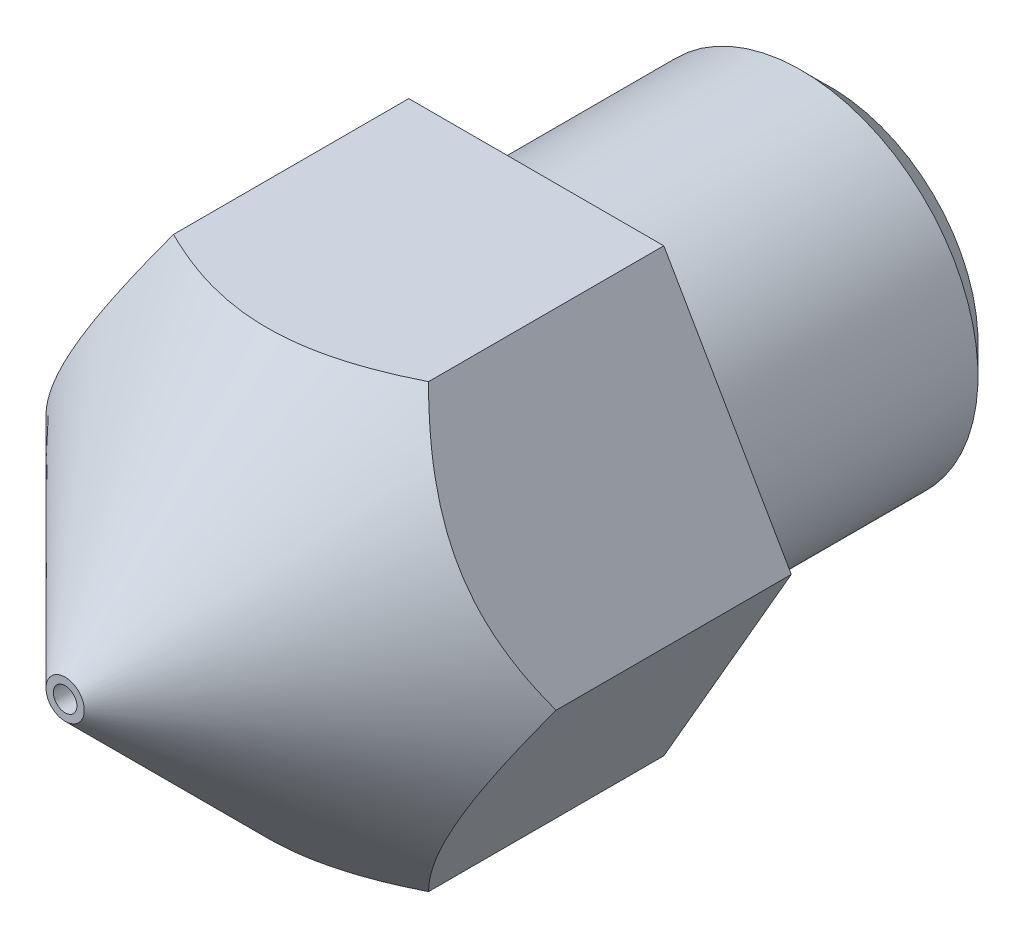
ISO-10303-21;
HEADER;
FILE_DESCRIPTION(('STEP AP214'),'2;1');
FILE_NAME('part.step','',(''),(''),'','','');
FILE_SCHEMA(('AUTOMOTIVE_DESIGN { 1 0 10303 214 1 1 1 1 }'));
ENDSEC;
DATA;
#1=APPLICATION_CONTEXT('core data for automotive mechanical design processes');
#2=APPLICATION_PROTOCOL_DEFINITION('international standard','automotive_design',2000,#1);
#3=PRODUCT_CONTEXT('',#1,'mechanical');
#4=PRODUCT('Part','Part','',(#3));
#5=PRODUCT_RELATED_PRODUCT_CATEGORY('part','',(#4));
#6=PRODUCT_DEFINITION_FORMATION('','',#4);
#7=PRODUCT_DEFINITION_CONTEXT('part definition',#1,'design');
#8=PRODUCT_DEFINITION('design','',#6,#7);
#9=PRODUCT_DEFINITION_SHAPE('','',#8);
#10=(LENGTH_UNIT() NAMED_UNIT(*) SI_UNIT(.MILLI.,.METRE.));
#11=(NAMED_UNIT(*) PLANE_ANGLE_UNIT() SI_UNIT($,.RADIAN.));
#12=(NAMED_UNIT(*) SI_UNIT($,.STERADIAN.) SOLID_ANGLE_UNIT());
#13=UNCERTAINTY_MEASURE_WITH_UNIT(LENGTH_MEASURE(1.E-05),#10,'distance_accuracy_value','');
#14=(GEOMETRIC_REPRESENTATION_CONTEXT(3) GLOBAL_UNCERTAINTY_ASSIGNED_CONTEXT((#13)) GLOBAL_UNIT_ASSIGNED_CONTEXT((#10,
#11,#12)) REPRESENTATION_CONTEXT('',''));
#15=CARTESIAN_POINT('',(0.,0.,0.));
#16=DIRECTION('',(0.,0.,1.));
#17=DIRECTION('',(1.,0.,0.));
#18=AXIS2_PLACEMENT_3D('',#15,#16,#17);
#19=CARTESIAN_POINT('',(0.,0.,13.));
#20=DIRECTION('',(0.,0.,-1.));
#21=DIRECTION('',(-1.,0.,0.));
#22=AXIS2_PLACEMENT_3D('',#19,#20,#21);
#23=CONICAL_SURFACE('',#22,0.325000000000002,0.785398163397447);
#24=CARTESIAN_POINT('',(0.,0.,13.));
#25=DIRECTION('',(0.,0.,-1.));
#26=DIRECTION('',(-1.,0.,0.));
#27=AXIS2_PLACEMENT_3D('',#24,#25,#26);
#28=CIRCLE('',#27,0.325000000000002);
#29=CARTESIAN_POINT('',(-0.325000000000002,0.,13.));
#30=VERTEX_POINT('',#29);
#31=EDGE_CURVE('E189',#30,#30,#28,.T.);
#32=ORIENTED_EDGE('',*,*,#31,.T.);
#33=EDGE_LOOP('',(#32));
#34=FACE_BOUND('',#33,.T.);
#35=CARTESIAN_POINT('',(2.16494803940726,3.7502,8.99475750640527));
#36=CARTESIAN_POINT('',(2.20217705704305,3.68571744993894,9.03198286474026));
#37=CARTESIAN_POINT('',(2.23969096480962,3.62074145569679,9.06806617459662));
#38=CARTESIAN_POINT('',(2.31534724663345,3.48970093166616,9.13760057553458));
#39=CARTESIAN_POINT('',(2.35348995039741,3.42363583080893,9.17105022890731));
#40=CARTESIAN_POINT('',(2.46930370458929,3.22304052433329,9.26721179995003));
#41=CARTESIAN_POINT('',(2.54795906193632,3.08680544912077,9.32532603800888));
#42=CARTESIAN_POINT('',(2.70654314168565,2.81212976572336,9.4248497124022));
#43=CARTESIAN_POINT('',(2.7864318058688,2.67375854040935,9.46650977518386));
#44=CARTESIAN_POINT('',(2.94797321962136,2.3939606042634,9.53070134886704));
#45=CARTESIAN_POINT('',(3.02962102165828,2.25254246280913,9.5532807529882));
#46=CARTESIAN_POINT('',(3.17033742746209,2.00881449849844,9.57365267581302));
#47=CARTESIAN_POINT('',(3.22922472766649,1.90681870262386,9.57666772541387));
#48=CARTESIAN_POINT('',(3.34690375410711,1.70299264984347,9.57158555664633));
#49=CARTESIAN_POINT('',(3.4056954396071,1.60116246349488,9.56348444279472));
#50=CARTESIAN_POINT('',(3.52272175140972,1.39846694563034,9.53663202755894));
#51=CARTESIAN_POINT('',(3.5809556804583,1.29760282179385,9.51786881430989));
#52=CARTESIAN_POINT('',(3.69642340427653,1.09760685750634,9.47071645004091));
#53=CARTESIAN_POINT('',(3.75365727537385,0.998474884851932,9.44232803705166));
#54=CARTESIAN_POINT('',(3.85526187899324,0.822490549100253,9.38392137074101));
#55=CARTESIAN_POINT('',(3.89985755017936,0.745248580808259,9.35543868943839));
#56=CARTESIAN_POINT('',(3.98824830682869,0.592151299372155,9.29388306115367));
#57=CARTESIAN_POINT('',(4.03204336787686,0.516296028516144,9.26080997444805));
#58=CARTESIAN_POINT('',(4.11869492515951,0.366211128747631,9.19081496732349));
#59=CARTESIAN_POINT('',(4.16155388593438,0.29197723112596,9.15390514980141));
#60=CARTESIAN_POINT('',(4.24647809631472,0.144884183954545,9.07672137714441));
#61=CARTESIAN_POINT('',(4.28854381375498,0.0720242240911695,9.03644948611482));
#62=CARTESIAN_POINT('',(4.33024248897603,-0.000200000000002146,8.99475750640527));
#63=B_SPLINE_CURVE_WITH_KNOTS('',3,(#35,#36,#37,#38,#39,#40,#41,#42,#43,#44,#45,#46,#47,#48,#49,
#50,#51,#52,#53,#54,#55,#56,#57,#58,#59,#60,#61,#62),.UNSPECIFIED.,.F.,.F.,(4,2,2,2,2,2,2,2,2,2,
2,2,2,4),(0.,0.249716048117295,0.49956748405372,1.00196815812475,1.49639040117115,
1.98956790685464,2.34250890260464,2.69557361252159,3.04903354958699,3.40246639055996,
3.68322121867435,3.96398459432619,4.24388774030484,4.52362028927155),.UNSPECIFIED.);
#64=CARTESIAN_POINT('',(2.1650635094611,3.75,8.99487298107779));
#65=VERTEX_POINT('',#64);
#66=CARTESIAN_POINT('',(4.3301270189222,0.,8.99487298107779));
#67=VERTEX_POINT('',#66);
#68=EDGE_CURVE('E159',#65,#67,#63,.T.);
#69=ORIENTED_EDGE('',*,*,#68,.F.);
#70=CARTESIAN_POINT('',(-14.6386519959163,3.75,-1.78634117997296));
#71=CARTESIAN_POINT('',(-14.2499350475933,3.75,-1.40981785833932));
#72=CARTESIAN_POINT('',(-13.8607884049401,3.75,-1.03373620647734));
#73=CARTESIAN_POINT('',(-13.0812850755396,3.75,-0.282767389143212));
#74=CARTESIAN_POINT('',(-12.6909282952341,3.75,0.0921196791879649));
#75=CARTESIAN_POINT('',(-11.9073864829059,3.75,0.841599680461632));
#76=CARTESIAN_POINT('',(-11.5141963476314,3.75,1.21618728420928));
#77=CARTESIAN_POINT('',(-10.725832141377,3.75,1.96321691632955));
#78=CARTESIAN_POINT('',(-10.3306582042045,3.75,2.33565908586739));
#79=CARTESIAN_POINT('',(-9.48751415713359,3.75,3.12449457448067));
#80=CARTESIAN_POINT('',(-9.03917871061251,3.75,3.54049877142708));
#81=CARTESIAN_POINT('',(-8.36278170882862,3.75,4.16036229387595));
#82=CARTESIAN_POINT('',(-8.13664071094535,3.75,4.36631656706569));
#83=CARTESIAN_POINT('',(-7.68275517403944,3.75,4.77644818100323));
#84=CARTESIAN_POINT('',(-7.45501065185341,3.75,4.980625540358));
#85=CARTESIAN_POINT('',(-6.9979388297345,3.75,5.38632349583382));
#86=CARTESIAN_POINT('',(-6.76861536690088,3.75,5.58784840860894));
#87=CARTESIAN_POINT('',(-6.30739688109312,3.75,5.9879319993884));
#88=CARTESIAN_POINT('',(-6.07550191271853,3.75,6.18649074016273));
#89=CARTESIAN_POINT('',(-5.60843315979353,3.75,6.579549493808));
#90=CARTESIAN_POINT('',(-5.37326059170391,3.75,6.77405094894264));
#91=CARTESIAN_POINT('',(-4.89846240252294,3.75,7.15752567104833));
#92=CARTESIAN_POINT('',(-4.65883733346967,3.75,7.34649961596071));
#93=CARTESIAN_POINT('',(-4.30029035324444,3.75,7.61978930756026));
#94=CARTESIAN_POINT('',(-4.18372409705692,3.75,7.70719509419748));
#95=CARTESIAN_POINT('',(-3.9489488565422,3.75,7.87978681113343));
#96=CARTESIAN_POINT('',(-3.83073981613803,3.75,7.96497266536726));
#97=CARTESIAN_POINT('',(-3.5922594172301,3.75,8.13273291066193));
#98=CARTESIAN_POINT('',(-3.47198569560841,3.75,8.21530395229492));
#99=CARTESIAN_POINT('',(-3.22918850523287,3.75,8.37707527196928));
#100=CARTESIAN_POINT('',(-3.10666510596204,3.75,8.45627565386622));
#101=CARTESIAN_POINT('',(-2.8607550156929,3.75,8.60935681121756));
#102=CARTESIAN_POINT('',(-2.73740582657593,3.75,8.68329753260382));
#103=CARTESIAN_POINT('',(-2.48771602937876,3.75,8.82602971275283));
#104=CARTESIAN_POINT('',(-2.36137493205706,3.75,8.89482032160027));
#105=CARTESIAN_POINT('',(-2.1055604004599,3.75,9.02571742567049));
#106=CARTESIAN_POINT('',(-1.97609357884479,3.75,9.08783673614048));
#107=CARTESIAN_POINT('',(-1.71351357955835,3.75,9.20374230228365));
#108=CARTESIAN_POINT('',(-1.58040236195262,3.75,9.25753293764283));
#109=CARTESIAN_POINT('',(-1.32791809670304,3.75,9.34833524201216));
#110=CARTESIAN_POINT('',(-1.20900671407626,3.75,9.38661885295907));
#111=CARTESIAN_POINT('',(-0.968499851293341,3.75,9.45367341653336));
#112=CARTESIAN_POINT('',(-0.846904577001409,3.75,9.48244509607407));
#113=CARTESIAN_POINT('',(-0.602349977135241,3.75,9.52881560897667));
#114=CARTESIAN_POINT('',(-0.47940382096303,3.75,9.54648275164277));
#115=CARTESIAN_POINT('',(-0.232368181245821,3.75,9.56981833085271));
#116=CARTESIAN_POINT('',(-0.108278826510831,3.75,9.57548810298873));
#117=CARTESIAN_POINT('',(0.136057623209196,3.75,9.57446138393147));
#118=CARTESIAN_POINT('',(0.256306465037792,3.75,9.56813681512276));
#119=CARTESIAN_POINT('',(0.495671858674488,3.75,9.54425936151283));
#120=CARTESIAN_POINT('',(0.614788342097327,3.75,9.52670580288889));
#121=CARTESIAN_POINT('',(0.851731653992345,3.75,9.48126041894918));
#122=CARTESIAN_POINT('',(0.9695466812008,3.75,9.45330803666982));
#123=CARTESIAN_POINT('',(1.20266463899952,3.75,9.38845899970364));
#124=CARTESIAN_POINT('',(1.31796732369718,3.75,9.35156147376884));
#125=CARTESIAN_POINT('',(1.55710974511649,3.75,9.26625599478381));
#126=CARTESIAN_POINT('',(1.68066993399641,3.75,9.21707173061441));
#127=CARTESIAN_POINT('',(1.92462614014912,3.75,9.11138034985307));
#128=CARTESIAN_POINT('',(2.0450211462328,3.75,9.05487092646162));
#129=CARTESIAN_POINT('',(2.28306265861194,3.75,8.93589646370744));
#130=CARTESIAN_POINT('',(2.40070418203018,3.75,8.87342153161685));
#131=CARTESIAN_POINT('',(2.63333307868828,3.75,8.74377540724685));
#132=CARTESIAN_POINT('',(2.74832079999608,3.75,8.67660483554894));
#133=CARTESIAN_POINT('',(2.97749092968317,3.75,8.53756353312444));
#134=CARTESIAN_POINT('',(3.09164263783865,3.75,8.46564243772143));
#135=CARTESIAN_POINT('',(3.31789567554612,3.75,8.31865021869839));
#136=CARTESIAN_POINT('',(3.42999695238471,3.75,8.24357901425692));
#137=CARTESIAN_POINT('',(3.65231370578582,3.75,8.09094114965254));
#138=CARTESIAN_POINT('',(3.76253099312431,3.75,8.01337711917717));
#139=CARTESIAN_POINT('',(3.98143415992465,3.75,7.85613141319268));
#140=CARTESIAN_POINT('',(4.09012009842175,3.75,7.77644981966172));
#141=CARTESIAN_POINT('',(4.32458059261932,3.75,7.60159225853655));
#142=CARTESIAN_POINT('',(4.4501112576079,3.75,7.50608967885561));
#143=CARTESIAN_POINT('',(4.69964235334507,3.75,7.31310345339998));
#144=CARTESIAN_POINT('',(4.82364273721207,3.75,7.2156197471726));
#145=CARTESIAN_POINT('',(5.19372861565919,3.75,6.92070492662386));
#146=CARTESIAN_POINT('',(5.43786875300338,3.75,6.72083281307475));
#147=CARTESIAN_POINT('',(5.9224357281442,3.75,6.31643351655192));
#148=CARTESIAN_POINT('',(6.16286074352854,3.75,6.11190416354314));
#149=CARTESIAN_POINT('',(6.64082051717539,3.75,5.69948896715153));
#150=CARTESIAN_POINT('',(6.87835519736209,3.75,5.49160303344976));
#151=CARTESIAN_POINT('',(7.35171780729667,3.75,5.07284513561662));
#152=CARTESIAN_POINT('',(7.58754075135803,3.75,4.8619675476267));
#153=CARTESIAN_POINT('',(8.05742267917519,3.75,4.43825202887371));
#154=CARTESIAN_POINT('',(8.2914816372209,3.75,4.22541406963829));
#155=CARTESIAN_POINT('',(8.99142216149712,3.75,3.58474290256203));
#156=CARTESIAN_POINT('',(9.45521092254354,3.75,3.15462442258876));
#157=CARTESIAN_POINT('',(10.3245425469641,3.75,2.34145853210023));
#158=CARTESIAN_POINT('',(10.7304970398764,3.75,1.95884952292607));
#159=CARTESIAN_POINT('',(11.5403293668149,3.75,1.1913694393374));
#160=CARTESIAN_POINT('',(11.9442070146313,3.75,0.806498168496878));
#161=CARTESIAN_POINT('',(12.7487672717472,3.75,0.0366620574756648));
#162=CARTESIAN_POINT('',(13.1494561983004,3.75,-0.348296188306188));
#163=CARTESIAN_POINT('',(13.9495703198245,3.75,-1.1194426635813));
#164=CARTESIAN_POINT('',(14.3489956394169,3.75,-1.50563076373316));
#165=CARTESIAN_POINT('',(14.7479791513934,3.75,-1.89227272049551));
#166=B_SPLINE_CURVE_WITH_KNOTS('',3,(#70,#71,#72,#73,#74,#75,#76,#77,#78,#79,#80,#81,#82,#83,
#84,#85,#86,#87,#88,#89,#90,#91,#92,#93,#94,#95,#96,#97,#98,#99,#100,#101,#102,#103,#104,#105,
#106,#107,#108,#109,#110,#111,#112,#113,#114,#115,#116,#117,#118,#119,#120,#121,#122,#123,#124,
#125,#126,#127,#128,#129,#130,#131,#132,#133,#134,#135,#136,#137,#138,#139,#140,#141,#142,#143,
#144,#145,#146,#147,#148,#149,#150,#151,#152,#153,#154,#155,#156,#157,#158,#159,#160,#161,#162,
#163,#164,#165),.UNSPECIFIED.,.F.,.F.,(4,2,2,2,2,2,2,2,2,2,2,2,2,2,2,2,2,2,2,2,2,2,2,2,2,2,2,2,
2,2,2,2,2,2,2,2,2,2,2,2,2,2,2,2,2,2,2,4),(0.,1.62352743360012,3.24718368180129,4.8763577567919,
6.50542338211818,8.3402097775912,9.25781508224569,10.175410766601,11.0912601475699,
12.007090119844,12.9225887899531,13.8379747005741,14.2750438553496,14.7121279664473,
15.1497510001848,15.5873605402593,16.0187020504601,16.4501145881038,16.8806829930107,
17.3110242061778,17.6854613442487,18.0598698607616,18.431952072021,18.8039928595166,
19.1646856088408,19.5254000044374,19.8882487473001,20.2511328454733,20.6498058257267,
21.0486046603172,21.4480767131981,21.8474960708097,22.2521913643678,22.6568970474321,
23.0611889805571,23.4654652848866,23.9386296389294,24.4118084529913,25.3582791075872,
26.305200177966,27.2521467707189,28.2012045055311,29.1502760462152,31.0478422382499,
32.7213626112971,34.3950305036326,36.0619709984686,37.7287416208617),.UNSPECIFIED.);
#167=CARTESIAN_POINT('',(-2.1650635094611,3.75,8.99487298107779));
#168=VERTEX_POINT('',#167);
#169=EDGE_CURVE('E166',#168,#65,#166,.T.);
#170=ORIENTED_EDGE('',*,*,#169,.F.);
#171=CARTESIAN_POINT('',(-4.33024248897603,-0.000199999999998916,8.99475750640528));
#172=CARTESIAN_POINT('',(-4.29301347134024,0.0642825500610654,9.03198286474026));
#173=CARTESIAN_POINT('',(-4.25549956357367,0.129258544303218,9.06806617459662));
#174=CARTESIAN_POINT('',(-4.17984328174984,0.260299068333847,9.13760057553458));
#175=CARTESIAN_POINT('',(-4.14170057798588,0.326364169191077,9.17105022890732));
#176=CARTESIAN_POINT('',(-4.02588682379399,0.526959475666708,9.26721179995003));
#177=CARTESIAN_POINT('',(-3.94723146644697,0.663194550879237,9.32532603800889));
#178=CARTESIAN_POINT('',(-3.78864738669763,0.937870234276646,9.42484971240221));
#179=CARTESIAN_POINT('',(-3.70875872251449,1.07624145959065,9.46650977518386));
#180=CARTESIAN_POINT('',(-3.54721730876193,1.3560393957366,9.53070134886705));
#181=CARTESIAN_POINT('',(-3.46556950672501,1.49745753719087,9.55328075298821));
#182=CARTESIAN_POINT('',(-3.3248531009212,1.74118550150156,9.57365267581302));
#183=CARTESIAN_POINT('',(-3.2659658007168,1.84318129737614,9.57666772541387));
#184=CARTESIAN_POINT('',(-3.14828677427618,2.04700735015653,9.57158555664633));
#185=CARTESIAN_POINT('',(-3.08949508877619,2.14883753650512,9.56348444279473));
#186=CARTESIAN_POINT('',(-2.97246877697357,2.35153305436966,9.53663202755894));
#187=CARTESIAN_POINT('',(-2.91423484792499,2.45239717820615,9.51786881430989));
#188=CARTESIAN_POINT('',(-2.79876712410676,2.65239314249366,9.47071645004091));
#189=CARTESIAN_POINT('',(-2.74153325300944,2.75152511514807,9.44232803705166));
#190=CARTESIAN_POINT('',(-2.63992864939005,2.92750945089975,9.38392137074101));
#191=CARTESIAN_POINT('',(-2.59533297820393,3.00475141919174,9.35543868943839));
#192=CARTESIAN_POINT('',(-2.5069422215546,3.15784870062784,9.29388306115368));
#193=CARTESIAN_POINT('',(-2.46314716050643,3.23370397148386,9.26080997444805));
#194=CARTESIAN_POINT('',(-2.37649560322378,3.38378887125237,9.19081496732349));
#195=CARTESIAN_POINT('',(-2.33363664244891,3.45802276887404,9.15390514980141));
#196=CARTESIAN_POINT('',(-2.24871243206857,3.60511581604545,9.07672137714441));
#197=CARTESIAN_POINT('',(-2.20664671462831,3.67797577590883,9.03644948611482));
#198=CARTESIAN_POINT('',(-2.16494803940726,3.7502,8.99475750640527));
#199=B_SPLINE_CURVE_WITH_KNOTS('',3,(#171,#172,#173,#174,#175,#176,#177,#178,#179,#180,#181,
#182,#183,#184,#185,#186,#187,#188,#189,#190,#191,#192,#193,#194,#195,#196,#197,#198),
.UNSPECIFIED.,.F.,.F.,(4,2,2,2,2,2,2,2,2,2,2,2,2,4),(0.,0.249716048117296,0.49956748405372,
1.00196815812475,1.49639040117115,1.98956790685463,2.34250890260463,2.69557361252159,
3.04903354958698,3.40246639055995,3.68322121867434,3.96398459432618,4.24388774030484,
4.52362028927154),.UNSPECIFIED.);
#200=CARTESIAN_POINT('',(-4.33012701892219,0.,8.99487298107779));
#201=VERTEX_POINT('',#200);
#202=EDGE_CURVE('E223',#201,#168,#199,.T.);
#203=ORIENTED_EDGE('',*,*,#202,.F.);
#204=CARTESIAN_POINT('',(-2.16494803940726,-3.7502,8.99475750640527));
#205=CARTESIAN_POINT('',(-2.20217705704305,-3.68571744993894,9.03198286474026));
#206=CARTESIAN_POINT('',(-2.23969096480962,-3.62074145569679,9.06806617459662));
#207=CARTESIAN_POINT('',(-2.31534724663345,-3.48970093166616,9.13760057553458));
#208=CARTESIAN_POINT('',(-2.35348995039741,-3.42363583080893,9.17105022890731));
#209=CARTESIAN_POINT('',(-2.46930370458929,-3.22304052433329,9.26721179995003));
#210=CARTESIAN_POINT('',(-2.54795906193632,-3.08680544912076,9.32532603800888));
#211=CARTESIAN_POINT('',(-2.70654314168566,-2.81212976572335,9.4248497124022));
#212=CARTESIAN_POINT('',(-2.7864318058688,-2.67375854040935,9.46650977518386));
#213=CARTESIAN_POINT('',(-2.94797321962136,-2.3939606042634,9.53070134886704));
#214=CARTESIAN_POINT('',(-3.02962102165828,-2.25254246280912,9.55328075298821));
#215=CARTESIAN_POINT('',(-3.1703374274621,-2.00881449849844,9.57365267581302));
#216=CARTESIAN_POINT('',(-3.22922472766649,-1.90681870262386,9.57666772541387));
#217=CARTESIAN_POINT('',(-3.34690375410711,-1.70299264984347,9.57158555664633));
#218=CARTESIAN_POINT('',(-3.4056954396071,-1.60116246349488,9.56348444279472));
#219=CARTESIAN_POINT('',(-3.52272175140972,-1.39846694563034,9.53663202755894));
#220=CARTESIAN_POINT('',(-3.5809556804583,-1.29760282179385,9.51786881430989));
#221=CARTESIAN_POINT('',(-3.69642340427653,-1.09760685750633,9.47071645004091));
#222=CARTESIAN_POINT('',(-3.75365727537385,-0.998474884851929,9.44232803705166));
#223=CARTESIAN_POINT('',(-3.85526187899324,-0.822490549100251,9.38392137074101));
#224=CARTESIAN_POINT('',(-3.89985755017936,-0.745248580808257,9.35543868943839));
#225=CARTESIAN_POINT('',(-3.98824830682869,-0.592151299372154,9.29388306115368));
#226=CARTESIAN_POINT('',(-4.03204336787686,-0.516296028516144,9.26080997444805));
#227=CARTESIAN_POINT('',(-4.11869492515951,-0.366211128747631,9.19081496732349));
#228=CARTESIAN_POINT('',(-4.16155388593438,-0.29197723112596,9.15390514980142));
#229=CARTESIAN_POINT('',(-4.24647809631472,-0.144884183954546,9.07672137714441));
#230=CARTESIAN_POINT('',(-4.28854381375498,-0.0720242240911709,9.03644948611482));
#231=CARTESIAN_POINT('',(-4.33024248897603,0.000200000000000121,8.99475750640528));
#232=B_SPLINE_CURVE_WITH_KNOTS('',3,(#204,#205,#206,#207,#208,#209,#210,#211,#212,#213,#214,
#215,#216,#217,#218,#219,#220,#221,#222,#223,#224,#225,#226,#227,#228,#229,#230,#231),
.UNSPECIFIED.,.F.,.F.,(4,2,2,2,2,2,2,2,2,2,2,2,2,4),(0.,0.249716048117295,0.499567484053721,
1.00196815812475,1.49639040117115,1.98956790685464,2.34250890260464,2.69557361252159,
3.04903354958699,3.40246639055996,3.68322121867435,3.96398459432619,4.24388774030484,
4.52362028927154),.UNSPECIFIED.);
#233=CARTESIAN_POINT('',(-2.1650635094611,-3.75,8.99487298107779));
#234=VERTEX_POINT('',#233);
#235=EDGE_CURVE('E224',#234,#201,#232,.T.);
#236=ORIENTED_EDGE('',*,*,#235,.F.);
#237=CARTESIAN_POINT('',(-14.6386519959164,-3.75000000000001,-1.786341179973));
#238=CARTESIAN_POINT('',(-14.2499350475934,-3.75000000000001,-1.40981785833936));
#239=CARTESIAN_POINT('',(-13.8607884049402,-3.75,-1.03373620647738));
#240=CARTESIAN_POINT('',(-13.0812850755396,-3.75,-0.282767389143248));
#241=CARTESIAN_POINT('',(-12.6909282952342,-3.75,0.0921196791879325));
#242=CARTESIAN_POINT('',(-11.9073864829059,-3.75,0.841599680461604));
#243=CARTESIAN_POINT('',(-11.5141963476314,-3.75,1.21618728420925));
#244=CARTESIAN_POINT('',(-10.725832141377,-3.75,1.96321691632953));
#245=CARTESIAN_POINT('',(-10.3306582042045,-3.75,2.33565908586737));
#246=CARTESIAN_POINT('',(-9.4875141571336,-3.75,3.12449457448066));
#247=CARTESIAN_POINT('',(-9.03917871061252,-3.75,3.54049877142707));
#248=CARTESIAN_POINT('',(-8.36278170882863,-3.75,4.16036229387594));
#249=CARTESIAN_POINT('',(-8.13664071094535,-3.75,4.36631656706568));
#250=CARTESIAN_POINT('',(-7.68275517403944,-3.75,4.77644818100323));
#251=CARTESIAN_POINT('',(-7.45501065185341,-3.75,4.98062554035799));
#252=CARTESIAN_POINT('',(-6.9979388297345,-3.75,5.38632349583382));
#253=CARTESIAN_POINT('',(-6.76861536690087,-3.75,5.58784840860895));
#254=CARTESIAN_POINT('',(-6.30739688109311,-3.75,5.98793199938841));
#255=CARTESIAN_POINT('',(-6.07550191271852,-3.75,6.18649074016274));
#256=CARTESIAN_POINT('',(-5.60843315979352,-3.75,6.57954949380801));
#257=CARTESIAN_POINT('',(-5.37326059170389,-3.75,6.77405094894265));
#258=CARTESIAN_POINT('',(-4.89846240252292,-3.75,7.15752567104834));
#259=CARTESIAN_POINT('',(-4.65883733346965,-3.75,7.34649961596072));
#260=CARTESIAN_POINT('',(-4.30029035324442,-3.75,7.61978930756027));
#261=CARTESIAN_POINT('',(-4.1837240970569,-3.75,7.70719509419749));
#262=CARTESIAN_POINT('',(-3.94894885654218,-3.75,7.87978681113345));
#263=CARTESIAN_POINT('',(-3.83073981613801,-3.75,7.96497266536727));
#264=CARTESIAN_POINT('',(-3.59225941723008,-3.75,8.13273291066194));
#265=CARTESIAN_POINT('',(-3.47198569560839,-3.75,8.21530395229493));
#266=CARTESIAN_POINT('',(-3.22918850523285,-3.75,8.37707527196929));
#267=CARTESIAN_POINT('',(-3.10666510596203,-3.75,8.45627565386623));
#268=CARTESIAN_POINT('',(-2.86075501569289,-3.75,8.60935681121756));
#269=CARTESIAN_POINT('',(-2.73740582657592,-3.75,8.68329753260382));
#270=CARTESIAN_POINT('',(-2.48771602937875,-3.75,8.82602971275283));
#271=CARTESIAN_POINT('',(-2.36137493205705,-3.75,8.89482032160027));
#272=CARTESIAN_POINT('',(-2.1055604004599,-3.75,9.02571742567049));
#273=CARTESIAN_POINT('',(-1.97609357884479,-3.75,9.08783673614048));
#274=CARTESIAN_POINT('',(-1.71351357955835,-3.75,9.20374230228364));
#275=CARTESIAN_POINT('',(-1.58040236195262,-3.75,9.25753293764282));
#276=CARTESIAN_POINT('',(-1.32791809670304,-3.75,9.34833524201216));
#277=CARTESIAN_POINT('',(-1.20900671407627,-3.75,9.38661885295907));
#278=CARTESIAN_POINT('',(-0.968499851293341,-3.75,9.45367341653336));
#279=CARTESIAN_POINT('',(-0.846904577001411,-3.75,9.48244509607407));
#280=CARTESIAN_POINT('',(-0.602349977135244,-3.75,9.52881560897667));
#281=CARTESIAN_POINT('',(-0.479403820963035,-3.75,9.54648275164277));
#282=CARTESIAN_POINT('',(-0.232368181245826,-3.75,9.56981833085271));
#283=CARTESIAN_POINT('',(-0.108278826510834,-3.75,9.57548810298873));
#284=CARTESIAN_POINT('',(0.136057623209194,-3.75,9.57446138393147));
#285=CARTESIAN_POINT('',(0.25630646503779,-3.75,9.56813681512276));
#286=CARTESIAN_POINT('',(0.495671858674487,-3.75,9.54425936151283));
#287=CARTESIAN_POINT('',(0.614788342097326,-3.75,9.52670580288889));
#288=CARTESIAN_POINT('',(0.851731653992343,-3.75,9.48126041894918));
#289=CARTESIAN_POINT('',(0.969546681200796,-3.75,9.45330803666982));
#290=CARTESIAN_POINT('',(1.20266463899952,-3.75,9.38845899970364));
#291=CARTESIAN_POINT('',(1.31796732369718,-3.75,9.35156147376884));
#292=CARTESIAN_POINT('',(1.55710974511649,-3.75,9.26625599478381));
#293=CARTESIAN_POINT('',(1.68066993399641,-3.75,9.21707173061441));
#294=CARTESIAN_POINT('',(1.92462614014912,-3.75,9.11138034985307));
#295=CARTESIAN_POINT('',(2.0450211462328,-3.75,9.05487092646162));
#296=CARTESIAN_POINT('',(2.28306265861194,-3.75,8.93589646370744));
#297=CARTESIAN_POINT('',(2.40070418203018,-3.75,8.87342153161686));
#298=CARTESIAN_POINT('',(2.63333307868828,-3.75,8.74377540724685));
#299=CARTESIAN_POINT('',(2.74832079999608,-3.75,8.67660483554894));
#300=CARTESIAN_POINT('',(2.97749092968317,-3.75,8.53756353312444));
#301=CARTESIAN_POINT('',(3.09164263783865,-3.75,8.46564243772143));
#302=CARTESIAN_POINT('',(3.31789567554612,-3.75,8.31865021869839));
#303=CARTESIAN_POINT('',(3.4299969523847,-3.75,8.24357901425693));
#304=CARTESIAN_POINT('',(3.65231370578581,-3.75,8.09094114965254));
#305=CARTESIAN_POINT('',(3.7625309931243,-3.75,8.01337711917717));
#306=CARTESIAN_POINT('',(3.98143415992465,-3.75,7.85613141319269));
#307=CARTESIAN_POINT('',(4.09012009842174,-3.75,7.77644981966172));
#308=CARTESIAN_POINT('',(4.32458059261931,-3.75,7.60159225853655));
#309=CARTESIAN_POINT('',(4.4501112576079,-3.75,7.50608967885562));
#310=CARTESIAN_POINT('',(4.69964235334507,-3.75,7.31310345339998));
#311=CARTESIAN_POINT('',(4.82364273721207,-3.75,7.2156197471726));
#312=CARTESIAN_POINT('',(5.19372861565919,-3.75,6.92070492662386));
#313=CARTESIAN_POINT('',(5.43786875300337,-3.75,6.72083281307476));
#314=CARTESIAN_POINT('',(5.92243572814419,-3.75,6.31643351655192));
#315=CARTESIAN_POINT('',(6.16286074352854,-3.75,6.11190416354314));
#316=CARTESIAN_POINT('',(6.64082051717538,-3.75,5.69948896715153));
#317=CARTESIAN_POINT('',(6.87835519736208,-3.75,5.49160303344977));
#318=CARTESIAN_POINT('',(7.35171780729667,-3.75,5.07284513561662));
#319=CARTESIAN_POINT('',(7.58754075135802,-3.75,4.86196754762671));
#320=CARTESIAN_POINT('',(8.05742267917519,-3.75,4.43825202887371));
#321=CARTESIAN_POINT('',(8.2914816372209,-3.75,4.2254140696383));
#322=CARTESIAN_POINT('',(8.99142216149711,-3.75,3.58474290256203));
#323=CARTESIAN_POINT('',(9.45521092254354,-3.75,3.15462442258877));
#324=CARTESIAN_POINT('',(10.3245425469641,-3.75,2.34145853210024));
#325=CARTESIAN_POINT('',(10.7304970398764,-3.75,1.95884952292608));
#326=CARTESIAN_POINT('',(11.5403293668149,-3.75,1.19136943933741));
#327=CARTESIAN_POINT('',(11.9442070146312,-3.75,0.806498168496894));
#328=CARTESIAN_POINT('',(12.7487672717471,-3.75,0.0366620574756828));
#329=CARTESIAN_POINT('',(13.1494561983004,-3.75,-0.348296188306172));
#330=CARTESIAN_POINT('',(13.9495703198245,-3.75,-1.11944266358128));
#331=CARTESIAN_POINT('',(14.3489956394169,-3.75,-1.50563076373314));
#332=CARTESIAN_POINT('',(14.7479791513934,-3.75,-1.89227272049549));
#333=B_SPLINE_CURVE_WITH_KNOTS('',3,(#237,#238,#239,#240,#241,#242,#243,#244,#245,#246,#247,
#248,#249,#250,#251,#252,#253,#254,#255,#256,#257,#258,#259,#260,#261,#262,#263,#264,#265,#266,
#267,#268,#269,#270,#271,#272,#273,#274,#275,#276,#277,#278,#279,#280,#281,#282,#283,#284,#285,
#286,#287,#288,#289,#290,#291,#292,#293,#294,#295,#296,#297,#298,#299,#300,#301,#302,#303,#304,
#305,#306,#307,#308,#309,#310,#311,#312,#313,#314,#315,#316,#317,#318,#319,#320,#321,#322,#323,
#324,#325,#326,#327,#328,#329,#330,#331,#332),.UNSPECIFIED.,.F.,.F.,(4,2,2,2,2,2,2,2,2,2,2,2,2,
2,2,2,2,2,2,2,2,2,2,2,2,2,2,2,2,2,2,2,2,2,2,2,2,2,2,2,2,2,2,2,2,2,2,4),(0.,1.62352743360013,
3.24718368180131,4.87635775679193,6.50542338211822,8.34020977759126,9.25781508224575,
10.1754107666011,11.09126014757,12.007090119844,12.9225887899532,13.8379747005742,
14.2750438553497,14.7121279664474,15.1497510001849,15.5873605402594,16.0187020504601,
16.4501145881039,16.8806829930107,17.3110242061779,17.6854613442487,18.0598698607616,
18.431952072021,18.8039928595167,19.1646856088409,19.5254000044375,19.8882487473002,
20.2511328454734,20.6498058257268,21.0486046603172,21.4480767131981,21.8474960708098,
22.2521913643679,22.6568970474322,23.0611889805572,23.4654652848866,23.9386296389294,
24.4118084529914,25.3582791075872,26.305200177966,27.252146770719,28.2012045055312,
29.1502760462153,31.0478422382499,32.7213626112972,34.3950305036326,36.0619709984686,
37.7287416208618),.UNSPECIFIED.);
#334=CARTESIAN_POINT('',(2.1650635094611,-3.75,8.99487298107779));
#335=VERTEX_POINT('',#334);
#336=EDGE_CURVE('E94',#335,#234,#333,.F.);
#337=ORIENTED_EDGE('',*,*,#336,.F.);
#338=CARTESIAN_POINT('',(4.33024248897603,0.000199999999997417,8.99475750640527));
#339=CARTESIAN_POINT('',(4.29301347134024,-0.0642825500610668,9.03198286474026));
#340=CARTESIAN_POINT('',(4.25549956357367,-0.129258544303219,9.06806617459662));
#341=CARTESIAN_POINT('',(4.17984328174984,-0.260299068333848,9.13760057553458));
#342=CARTESIAN_POINT('',(4.14170057798588,-0.326364169191078,9.17105022890731));
#343=CARTESIAN_POINT('',(4.025886823794,-0.52695947566671,9.26721179995003));
#344=CARTESIAN_POINT('',(3.94723146644698,-0.663194550879238,9.32532603800888));
#345=CARTESIAN_POINT('',(3.78864738669764,-0.937870234276648,9.4248497124022));
#346=CARTESIAN_POINT('',(3.70875872251449,-1.07624145959066,9.46650977518386));
#347=CARTESIAN_POINT('',(3.54721730876193,-1.3560393957366,9.53070134886704));
#348=CARTESIAN_POINT('',(3.46556950672501,-1.49745753719088,9.5532807529882));
#349=CARTESIAN_POINT('',(3.3248531009212,-1.74118550150156,9.57365267581302));
#350=CARTESIAN_POINT('',(3.2659658007168,-1.84318129737614,9.57666772541387));
#351=CARTESIAN_POINT('',(3.14828677427618,-2.04700735015653,9.57158555664633));
#352=CARTESIAN_POINT('',(3.08949508877619,-2.14883753650512,9.56348444279472));
#353=CARTESIAN_POINT('',(2.97246877697357,-2.35153305436966,9.53663202755894));
#354=CARTESIAN_POINT('',(2.91423484792499,-2.45239717820615,9.51786881430989));
#355=CARTESIAN_POINT('',(2.79876712410676,-2.65239314249367,9.47071645004091));
#356=CARTESIAN_POINT('',(2.74153325300944,-2.75152511514807,9.44232803705166));
#357=CARTESIAN_POINT('',(2.63992864939005,-2.92750945089975,9.38392137074101));
#358=CARTESIAN_POINT('',(2.59533297820393,-3.00475141919174,9.35543868943839));
#359=CARTESIAN_POINT('',(2.5069422215546,-3.15784870062785,9.29388306115367));
#360=CARTESIAN_POINT('',(2.46314716050643,-3.23370397148386,9.26080997444805));
#361=CARTESIAN_POINT('',(2.37649560322378,-3.38378887125237,9.19081496732349));
#362=CARTESIAN_POINT('',(2.33363664244891,-3.45802276887404,9.15390514980141));
#363=CARTESIAN_POINT('',(2.24871243206857,-3.60511581604545,9.07672137714441));
#364=CARTESIAN_POINT('',(2.20664671462831,-3.67797577590883,9.03644948611482));
#365=CARTESIAN_POINT('',(2.16494803940726,-3.7502,8.99475750640527));
#366=B_SPLINE_CURVE_WITH_KNOTS('',3,(#338,#339,#340,#341,#342,#343,#344,#345,#346,#347,#348,
#349,#350,#351,#352,#353,#354,#355,#356,#357,#358,#359,#360,#361,#362,#363,#364,#365),
.UNSPECIFIED.,.F.,.F.,(4,2,2,2,2,2,2,2,2,2,2,2,2,4),(0.,0.249716048117296,0.49956748405372,
1.00196815812475,1.49639040117115,1.98956790685464,2.34250890260463,2.69557361252159,
3.04903354958699,3.40246639055995,3.68322121867435,3.96398459432618,4.24388774030484,
4.52362028927154),.UNSPECIFIED.);
#367=EDGE_CURVE('E124',#67,#335,#366,.T.);
#368=ORIENTED_EDGE('',*,*,#367,.F.);
#369=EDGE_LOOP('',(#69,#170,#203,#236,#337,#368));
#370=FACE_BOUND('',#369,.T.);
#371=ADVANCED_FACE('F38',(#34,#370),#23,.T.);
#372=CARTESIAN_POINT('',(0.,0.,5.));
#373=DIRECTION('',(0.,0.,-1.));
#374=DIRECTION('',(-1.,0.,0.));
#375=AXIS2_PLACEMENT_3D('',#372,#373,#374);
#376=PLANE('',#375);
#377=CARTESIAN_POINT('',(0.,0.,5.));
#378=DIRECTION('',(0.,0.,-1.));
#379=DIRECTION('',(-1.,0.,0.));
#380=AXIS2_PLACEMENT_3D('',#377,#378,#379);
#381=CIRCLE('',#380,3.);
#382=CARTESIAN_POINT('',(-3.,0.,5.));
#383=VERTEX_POINT('',#382);
#384=EDGE_CURVE('E186',#383,#383,#381,.T.);
#385=ORIENTED_EDGE('',*,*,#384,.F.);
#386=EDGE_LOOP('',(#385));
#387=FACE_BOUND('',#386,.T.);
#388=DIRECTION('',(1.,0.,0.));
#389=VECTOR('',#388,1.);
#390=CARTESIAN_POINT('',(-2.1650635094611,3.75,5.));
#391=LINE('',#390,#389);
#392=CARTESIAN_POINT('',(-2.1650635094611,3.75,5.));
#393=VERTEX_POINT('',#392);
#394=CARTESIAN_POINT('',(2.1650635094611,3.75,5.));
#395=VERTEX_POINT('',#394);
#396=EDGE_CURVE('E120',#393,#395,#391,.T.);
#397=ORIENTED_EDGE('',*,*,#396,.T.);
#398=DIRECTION('',(0.5,-0.866025403784438,0.));
#399=VECTOR('',#398,1.);
#400=CARTESIAN_POINT('',(2.1650635094611,3.75,5.));
#401=LINE('',#400,#399);
#402=CARTESIAN_POINT('',(4.3301270189222,0.,5.));
#403=VERTEX_POINT('',#402);
#404=EDGE_CURVE('E115',#395,#403,#401,.T.);
#405=ORIENTED_EDGE('',*,*,#404,.T.);
#406=DIRECTION('',(-0.5,-0.866025403784438,0.));
#407=VECTOR('',#406,1.);
#408=CARTESIAN_POINT('',(4.3301270189222,0.,5.));
#409=LINE('',#408,#407);
#410=CARTESIAN_POINT('',(2.1650635094611,-3.75,5.));
#411=VERTEX_POINT('',#410);
#412=EDGE_CURVE('E113',#403,#411,#409,.T.);
#413=ORIENTED_EDGE('',*,*,#412,.T.);
#414=DIRECTION('',(-1.,0.,0.));
#415=VECTOR('',#414,1.);
#416=CARTESIAN_POINT('',(2.1650635094611,-3.75,5.));
#417=LINE('',#416,#415);
#418=CARTESIAN_POINT('',(-2.1650635094611,-3.75,5.));
#419=VERTEX_POINT('',#418);
#420=EDGE_CURVE('E61',#411,#419,#417,.T.);
#421=ORIENTED_EDGE('',*,*,#420,.T.);
#422=DIRECTION('',(-0.499999999999999,0.866025403784439,0.));
#423=VECTOR('',#422,1.);
#424=CARTESIAN_POINT('',(-2.1650635094611,-3.75,5.));
#425=LINE('',#424,#423);
#426=CARTESIAN_POINT('',(-4.33012701892219,0.,5.));
#427=VERTEX_POINT('',#426);
#428=EDGE_CURVE('E101',#419,#427,#425,.T.);
#429=ORIENTED_EDGE('',*,*,#428,.T.);
#430=DIRECTION('',(0.5,0.866025403784439,0.));
#431=VECTOR('',#430,1.);
#432=CARTESIAN_POINT('',(-4.33012701892219,0.,5.));
#433=LINE('',#432,#431);
#434=EDGE_CURVE('E107',#427,#393,#433,.T.);
#435=ORIENTED_EDGE('',*,*,#434,.T.);
#436=EDGE_LOOP('',(#397,#405,#413,#421,#429,#435));
#437=FACE_BOUND('',#436,.T.);
#438=ADVANCED_FACE('F111',(#387,#437),#376,.T.);
#439=CARTESIAN_POINT('',(0.,0.,0.));
#440=DIRECTION('',(0.,0.,-1.));
#441=DIRECTION('',(-1.,0.,0.));
#442=AXIS2_PLACEMENT_3D('',#439,#440,#441);
#443=CYLINDRICAL_SURFACE('',#442,0.200000000000002);
#444=CARTESIAN_POINT('',(0.,0.,12.5));
#445=DIRECTION('',(0.,0.,-1.));
#446=DIRECTION('',(-1.,0.,0.));
#447=AXIS2_PLACEMENT_3D('',#444,#445,#446);
#448=CIRCLE('',#447,0.200000000000001);
#449=CARTESIAN_POINT('',(-0.200000000000001,0.,12.5));
#450=VERTEX_POINT('',#449);
#451=EDGE_CURVE('E165',#450,#450,#448,.T.);
#452=ORIENTED_EDGE('',*,*,#451,.T.);
#453=EDGE_LOOP('',(#452));
#454=FACE_BOUND('',#453,.T.);
#455=CARTESIAN_POINT('',(0.,0.,13.));
#456=DIRECTION('',(0.,0.,-1.));
#457=DIRECTION('',(-1.,0.,0.));
#458=AXIS2_PLACEMENT_3D('',#455,#456,#457);
#459=CIRCLE('',#458,0.200000000000002);
#460=CARTESIAN_POINT('',(-0.200000000000002,0.,13.));
#461=VERTEX_POINT('',#460);
#462=EDGE_CURVE('E192',#461,#461,#459,.T.);
#463=ORIENTED_EDGE('',*,*,#462,.F.);
#464=EDGE_LOOP('',(#463));
#465=FACE_BOUND('',#464,.T.);
#466=ADVANCED_FACE('F210',(#454,#465),#443,.F.);
#467=CARTESIAN_POINT('',(1.80411241501588E-13,0.,13.));
#468=DIRECTION('',(0.,0.,-1.));
#469=DIRECTION('',(-1.,0.,0.));
#470=AXIS2_PLACEMENT_3D('',#467,#468,#469);
#471=PLANE('',#470);
#472=ORIENTED_EDGE('',*,*,#31,.F.);
#473=EDGE_LOOP('',(#472));
#474=FACE_BOUND('',#473,.T.);
#475=ORIENTED_EDGE('',*,*,#462,.T.);
#476=EDGE_LOOP('',(#475));
#477=FACE_BOUND('',#476,.T.);
#478=ADVANCED_FACE('F259',(#474,#477),#471,.F.);
#479=CARTESIAN_POINT('',(0.,0.,0.));
#480=DIRECTION('',(0.,0.,-1.));
#481=DIRECTION('',(-1.,0.,0.));
#482=AXIS2_PLACEMENT_3D('',#479,#480,#481);
#483=CYLINDRICAL_SURFACE('',#482,3.);
#484=CARTESIAN_POINT('',(0.,0.,0.500000000000002));
#485=DIRECTION('',(0.,0.,-1.));
#486=DIRECTION('',(-1.,0.,0.));
#487=AXIS2_PLACEMENT_3D('',#484,#485,#486);
#488=CIRCLE('',#487,3.);
#489=CARTESIAN_POINT('',(-3.,0.,0.500000000000002));
#490=VERTEX_POINT('',#489);
#491=EDGE_CURVE('E11',#490,#490,#488,.F.);
#492=ORIENTED_EDGE('',*,*,#491,.T.);
#493=EDGE_LOOP('',(#492));
#494=FACE_BOUND('',#493,.T.);
#495=ORIENTED_EDGE('',*,*,#384,.T.);
#496=EDGE_LOOP('',(#495));
#497=FACE_BOUND('',#496,.T.);
#498=ADVANCED_FACE('F254',(#494,#497),#483,.T.);
#499=CARTESIAN_POINT('',(0.,0.,0.));
#500=DIRECTION('',(0.,0.,-1.));
#501=DIRECTION('',(-1.,0.,0.));
#502=AXIS2_PLACEMENT_3D('',#499,#500,#501);
#503=PLANE('',#502);
#504=CARTESIAN_POINT('',(0.,0.,0.));
#505=DIRECTION('',(0.,0.,-1.));
#506=DIRECTION('',(-1.,0.,0.));
#507=AXIS2_PLACEMENT_3D('',#504,#505,#506);
#508=CIRCLE('',#507,2.5);
#509=CARTESIAN_POINT('',(-2.5,0.,0.));
#510=VERTEX_POINT('',#509);
#511=EDGE_CURVE('E46',#510,#510,#508,.T.);
#512=ORIENTED_EDGE('',*,*,#511,.T.);
#513=EDGE_LOOP('',(#512));
#514=FACE_BOUND('',#513,.T.);
#515=CARTESIAN_POINT('',(0.,0.,0.));
#516=DIRECTION('',(0.,0.,-1.));
#517=DIRECTION('',(-1.,0.,0.));
#518=AXIS2_PLACEMENT_3D('',#515,#516,#517);
#519=CIRCLE('',#518,1.55);
#520=CARTESIAN_POINT('',(-1.55,0.,0.));
#521=VERTEX_POINT('',#520);
#522=EDGE_CURVE('E183',#521,#521,#519,.T.);
#523=ORIENTED_EDGE('',*,*,#522,.F.);
#524=EDGE_LOOP('',(#523));
#525=FACE_BOUND('',#524,.T.);
#526=ADVANCED_FACE('F197',(#514,#525),#503,.T.);
#527=CARTESIAN_POINT('',(0.,0.,0.));
#528=DIRECTION('',(0.,0.,-1.));
#529=DIRECTION('',(-1.,0.,0.));
#530=AXIS2_PLACEMENT_3D('',#527,#528,#529);
#531=CYLINDRICAL_SURFACE('',#530,1.55);
#532=CARTESIAN_POINT('',(0.,0.,1.));
#533=DIRECTION('',(0.,0.,-1.));
#534=DIRECTION('',(-1.,0.,0.));
#535=AXIS2_PLACEMENT_3D('',#532,#533,#534);
#536=CIRCLE('',#535,1.55);
#537=CARTESIAN_POINT('',(-1.55,0.,1.));
#538=VERTEX_POINT('',#537);
#539=EDGE_CURVE('E180',#538,#538,#536,.T.);
#540=ORIENTED_EDGE('',*,*,#539,.F.);
#541=EDGE_LOOP('',(#540));
#542=FACE_BOUND('',#541,.T.);
#543=ORIENTED_EDGE('',*,*,#522,.T.);
#544=EDGE_LOOP('',(#543));
#545=FACE_BOUND('',#544,.T.);
#546=ADVANCED_FACE('F269',(#542,#545),#531,.F.);
#547=CARTESIAN_POINT('',(0.,0.,1.));
#548=DIRECTION('',(0.,0.,1.));
#549=DIRECTION('',(1.,0.,0.));
#550=AXIS2_PLACEMENT_3D('',#547,#548,#549);
#551=PLANE('',#550);
#552=CARTESIAN_POINT('',(0.,0.,1.));
#553=DIRECTION('',(0.,0.,-1.));
#554=DIRECTION('',(-1.,0.,0.));
#555=AXIS2_PLACEMENT_3D('',#552,#553,#554);
#556=CIRCLE('',#555,1.);
#557=CARTESIAN_POINT('',(-1.,0.,1.));
#558=VERTEX_POINT('',#557);
#559=EDGE_CURVE('E177',#558,#558,#556,.T.);
#560=ORIENTED_EDGE('',*,*,#559,.F.);
#561=EDGE_LOOP('',(#560));
#562=FACE_BOUND('',#561,.T.);
#563=ORIENTED_EDGE('',*,*,#539,.T.);
#564=EDGE_LOOP('',(#563));
#565=FACE_BOUND('',#564,.T.);
#566=ADVANCED_FACE('F282',(#562,#565),#551,.F.);
#567=CARTESIAN_POINT('',(0.,0.,0.));
#568=DIRECTION('',(0.,0.,-1.));
#569=DIRECTION('',(-1.,0.,0.));
#570=AXIS2_PLACEMENT_3D('',#567,#568,#569);
#571=CYLINDRICAL_SURFACE('',#570,1.);
#572=CARTESIAN_POINT('',(0.,0.,10.9));
#573=DIRECTION('',(0.,0.,-1.));
#574=DIRECTION('',(-1.,0.,0.));
#575=AXIS2_PLACEMENT_3D('',#572,#573,#574);
#576=CIRCLE('',#575,1.);
#577=CARTESIAN_POINT('',(-1.,0.,10.9));
#578=VERTEX_POINT('',#577);
#579=EDGE_CURVE('E174',#578,#578,#576,.T.);
#580=ORIENTED_EDGE('',*,*,#579,.F.);
#581=EDGE_LOOP('',(#580));
#582=FACE_BOUND('',#581,.T.);
#583=ORIENTED_EDGE('',*,*,#559,.T.);
#584=EDGE_LOOP('',(#583));
#585=FACE_BOUND('',#584,.T.);
#586=ADVANCED_FACE('F290',(#582,#585),#571,.F.);
#587=CARTESIAN_POINT('',(0.,0.,10.9));
#588=DIRECTION('',(0.,0.,-1.));
#589=DIRECTION('',(-1.,0.,0.));
#590=AXIS2_PLACEMENT_3D('',#587,#588,#589);
#591=CONICAL_SURFACE('',#590,1.,0.463647609000806);
#592=ORIENTED_EDGE('',*,*,#451,.F.);
#593=EDGE_LOOP('',(#592));
#594=FACE_BOUND('',#593,.T.);
#595=ORIENTED_EDGE('',*,*,#579,.T.);
#596=EDGE_LOOP('',(#595));
#597=FACE_BOUND('',#596,.T.);
#598=ADVANCED_FACE('F155',(#594,#597),#591,.F.);
#599=CARTESIAN_POINT('',(2.1650635094611,3.75,15.));
#600=DIRECTION('',(0.866025403784439,0.5,0.));
#601=DIRECTION('',(-0.5,0.866025403784439,0.));
#602=AXIS2_PLACEMENT_3D('',#599,#600,#601);
#603=PLANE('',#602);
#604=ORIENTED_EDGE('',*,*,#68,.T.);
#605=DIRECTION('',(0.,0.,-1.));
#606=VECTOR('',#605,1.);
#607=CARTESIAN_POINT('',(4.3301270189222,0.,15.));
#608=LINE('',#607,#606);
#609=EDGE_CURVE('E53',#67,#403,#608,.T.);
#610=ORIENTED_EDGE('',*,*,#609,.T.);
#611=ORIENTED_EDGE('',*,*,#404,.F.);
#612=DIRECTION('',(0.,0.,-1.));
#613=VECTOR('',#612,1.);
#614=CARTESIAN_POINT('',(2.1650635094611,3.75,15.));
#615=LINE('',#614,#613);
#616=EDGE_CURVE('E122',#65,#395,#615,.T.);
#617=ORIENTED_EDGE('',*,*,#616,.F.);
#618=EDGE_LOOP('',(#604,#610,#611,#617));
#619=FACE_BOUND('',#618,.T.);
#620=ADVANCED_FACE('F150',(#619),#603,.T.);
#621=CARTESIAN_POINT('',(-2.1650635094611,3.75,15.));
#622=DIRECTION('',(0.,1.,0.));
#623=DIRECTION('',(-1.,0.,0.));
#624=AXIS2_PLACEMENT_3D('',#621,#622,#623);
#625=PLANE('',#624);
#626=ORIENTED_EDGE('',*,*,#169,.T.);
#627=ORIENTED_EDGE('',*,*,#616,.T.);
#628=ORIENTED_EDGE('',*,*,#396,.F.);
#629=DIRECTION('',(0.,0.,-1.));
#630=VECTOR('',#629,1.);
#631=CARTESIAN_POINT('',(-2.1650635094611,3.75,15.));
#632=LINE('',#631,#630);
#633=EDGE_CURVE('E125',#168,#393,#632,.T.);
#634=ORIENTED_EDGE('',*,*,#633,.F.);
#635=EDGE_LOOP('',(#626,#627,#628,#634));
#636=FACE_BOUND('',#635,.T.);
#637=ADVANCED_FACE('F154',(#636),#625,.T.);
#638=CARTESIAN_POINT('',(-4.33012701892219,0.,15.));
#639=DIRECTION('',(-0.866025403784439,0.5,0.));
#640=DIRECTION('',(-0.5,-0.866025403784439,0.));
#641=AXIS2_PLACEMENT_3D('',#638,#639,#640);
#642=PLANE('',#641);
#643=ORIENTED_EDGE('',*,*,#202,.T.);
#644=ORIENTED_EDGE('',*,*,#633,.T.);
#645=ORIENTED_EDGE('',*,*,#434,.F.);
#646=DIRECTION('',(0.,0.,-1.));
#647=VECTOR('',#646,1.);
#648=CARTESIAN_POINT('',(-4.33012701892219,0.,15.));
#649=LINE('',#648,#647);
#650=EDGE_CURVE('E97',#201,#427,#649,.T.);
#651=ORIENTED_EDGE('',*,*,#650,.F.);
#652=EDGE_LOOP('',(#643,#644,#645,#651));
#653=FACE_BOUND('',#652,.T.);
#654=ADVANCED_FACE('F233',(#653),#642,.T.);
#655=CARTESIAN_POINT('',(-2.1650635094611,-3.75,15.));
#656=DIRECTION('',(-0.866025403784439,-0.499999999999999,0.));
#657=DIRECTION('',(0.499999999999999,-0.866025403784439,0.));
#658=AXIS2_PLACEMENT_3D('',#655,#656,#657);
#659=PLANE('',#658);
#660=ORIENTED_EDGE('',*,*,#235,.T.);
#661=ORIENTED_EDGE('',*,*,#650,.T.);
#662=ORIENTED_EDGE('',*,*,#428,.F.);
#663=DIRECTION('',(0.,0.,-1.));
#664=VECTOR('',#663,1.);
#665=CARTESIAN_POINT('',(-2.1650635094611,-3.75,15.));
#666=LINE('',#665,#664);
#667=EDGE_CURVE('E90',#234,#419,#666,.T.);
#668=ORIENTED_EDGE('',*,*,#667,.F.);
#669=EDGE_LOOP('',(#660,#661,#662,#668));
#670=FACE_BOUND('',#669,.T.);
#671=ADVANCED_FACE('F102',(#670),#659,.T.);
#672=CARTESIAN_POINT('',(2.1650635094611,-3.75,15.));
#673=DIRECTION('',(0.,-1.,0.));
#674=DIRECTION('',(1.,0.,0.));
#675=AXIS2_PLACEMENT_3D('',#672,#673,#674);
#676=PLANE('',#675);
#677=ORIENTED_EDGE('',*,*,#336,.T.);
#678=ORIENTED_EDGE('',*,*,#667,.T.);
#679=ORIENTED_EDGE('',*,*,#420,.F.);
#680=DIRECTION('',(0.,0.,-1.));
#681=VECTOR('',#680,1.);
#682=CARTESIAN_POINT('',(2.1650635094611,-3.75,15.));
#683=LINE('',#682,#681);
#684=EDGE_CURVE('E98',#335,#411,#683,.T.);
#685=ORIENTED_EDGE('',*,*,#684,.F.);
#686=EDGE_LOOP('',(#677,#678,#679,#685));
#687=FACE_BOUND('',#686,.T.);
#688=ADVANCED_FACE('F92',(#687),#676,.T.);
#689=CARTESIAN_POINT('',(4.3301270189222,0.,15.));
#690=DIRECTION('',(0.866025403784438,-0.5,0.));
#691=DIRECTION('',(0.5,0.866025403784438,0.));
#692=AXIS2_PLACEMENT_3D('',#689,#690,#691);
#693=PLANE('',#692);
#694=ORIENTED_EDGE('',*,*,#367,.T.);
#695=ORIENTED_EDGE('',*,*,#684,.T.);
#696=ORIENTED_EDGE('',*,*,#412,.F.);
#697=ORIENTED_EDGE('',*,*,#609,.F.);
#698=EDGE_LOOP('',(#694,#695,#696,#697));
#699=FACE_BOUND('',#698,.T.);
#700=ADVANCED_FACE('F144',(#699),#693,.T.);
#701=CARTESIAN_POINT('',(0.,0.,0.));
#702=DIRECTION('',(0.,0.,1.));
#703=DIRECTION('',(1.,0.,0.));
#704=AXIS2_PLACEMENT_3D('',#701,#702,#703);
#705=CONICAL_SURFACE('',#704,2.5,0.785398163397447);
#706=ORIENTED_EDGE('',*,*,#491,.F.);
#707=EDGE_LOOP('',(#706));
#708=FACE_BOUND('',#707,.T.);
#709=ORIENTED_EDGE('',*,*,#511,.F.);
#710=EDGE_LOOP('',(#709));
#711=FACE_BOUND('',#710,.T.);
#712=ADVANCED_FACE('F40',(#708,#711),#705,.T.);
#713=CLOSED_SHELL('',(#371,#438,#466,#478,#498,#526,#546,#566,#586,#598,#620,#637,#654,#671,
#688,#700,#712));
#714=MANIFOLD_SOLID_BREP('B2',#713);
#715=ADVANCED_BREP_SHAPE_REPRESENTATION('',(#18,#714),#14);
#716=SHAPE_DEFINITION_REPRESENTATION(#9,#715);
ENDSEC;
END-ISO-10303-21;
